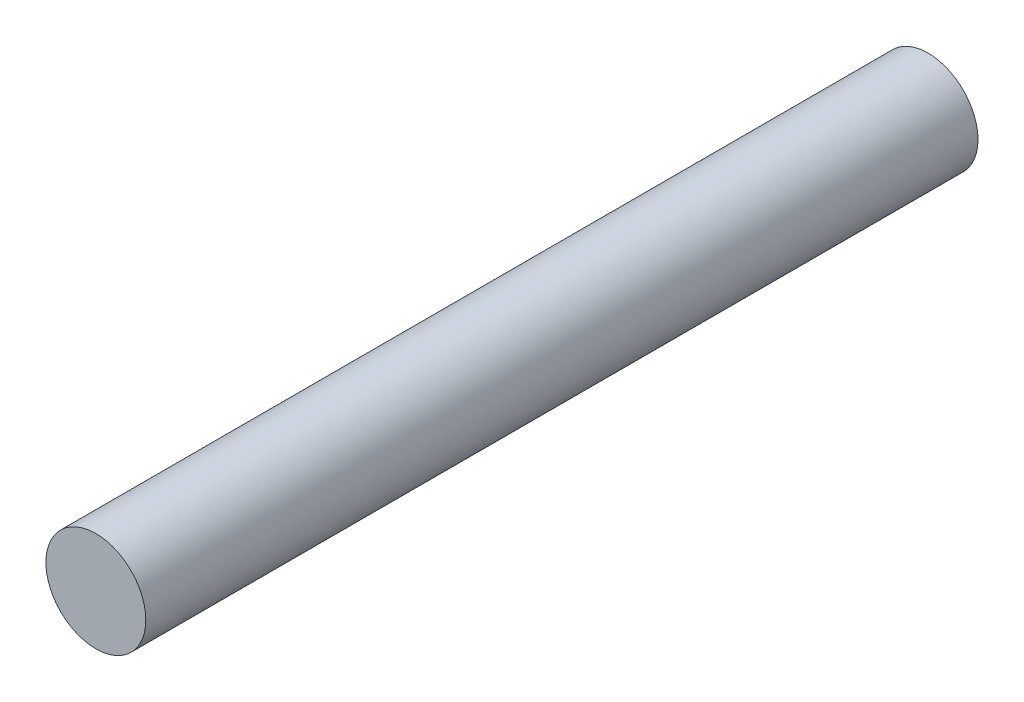
ISO-10303-21;
HEADER;
FILE_DESCRIPTION(('STEP AP214'),'2;1');
FILE_NAME('part.step','',(''),(''),'','','');
FILE_SCHEMA(('AUTOMOTIVE_DESIGN { 1 0 10303 214 1 1 1 1 }'));
ENDSEC;
DATA;
#1=APPLICATION_CONTEXT('core data for automotive mechanical design processes');
#2=APPLICATION_PROTOCOL_DEFINITION('international standard','automotive_design',2000,#1);
#3=PRODUCT_CONTEXT('',#1,'mechanical');
#4=PRODUCT('Part','Part','',(#3));
#5=PRODUCT_RELATED_PRODUCT_CATEGORY('part','',(#4));
#6=PRODUCT_DEFINITION_FORMATION('','',#4);
#7=PRODUCT_DEFINITION_CONTEXT('part definition',#1,'design');
#8=PRODUCT_DEFINITION('design','',#6,#7);
#9=PRODUCT_DEFINITION_SHAPE('','',#8);
#10=(LENGTH_UNIT() NAMED_UNIT(*) SI_UNIT(.MILLI.,.METRE.));
#11=(NAMED_UNIT(*) PLANE_ANGLE_UNIT() SI_UNIT($,.RADIAN.));
#12=(NAMED_UNIT(*) SI_UNIT($,.STERADIAN.) SOLID_ANGLE_UNIT());
#13=UNCERTAINTY_MEASURE_WITH_UNIT(LENGTH_MEASURE(1.E-05),#10,'distance_accuracy_value','');
#14=(GEOMETRIC_REPRESENTATION_CONTEXT(3) GLOBAL_UNCERTAINTY_ASSIGNED_CONTEXT((#13)) GLOBAL_UNIT_ASSIGNED_CONTEXT((#10,
#11,#12)) REPRESENTATION_CONTEXT('',''));
#15=CARTESIAN_POINT('',(0.,0.,0.));
#16=DIRECTION('',(0.,0.,1.));
#17=DIRECTION('',(1.,0.,0.));
#18=AXIS2_PLACEMENT_3D('',#15,#16,#17);
#19=CARTESIAN_POINT('',(0.,0.,25.));
#20=DIRECTION('',(0.,0.,-1.));
#21=DIRECTION('',(-1.,0.,0.));
#22=AXIS2_PLACEMENT_3D('',#19,#20,#21);
#23=CYLINDRICAL_SURFACE('',#22,1.5);
#24=CARTESIAN_POINT('',(0.,0.,25.));
#25=DIRECTION('',(0.,0.,1.));
#26=DIRECTION('',(1.,0.,0.));
#27=AXIS2_PLACEMENT_3D('',#24,#25,#26);
#28=CIRCLE('',#27,1.5);
#29=CARTESIAN_POINT('',(1.5,0.,25.));
#30=VERTEX_POINT('',#29);
#31=EDGE_CURVE('E10',#30,#30,#28,.T.);
#32=ORIENTED_EDGE('',*,*,#31,.F.);
#33=EDGE_LOOP('',(#32));
#34=FACE_BOUND('',#33,.T.);
#35=CARTESIAN_POINT('',(0.,0.,0.));
#36=DIRECTION('',(0.,0.,1.));
#37=DIRECTION('',(1.,0.,0.));
#38=AXIS2_PLACEMENT_3D('',#35,#36,#37);
#39=CIRCLE('',#38,1.5);
#40=CARTESIAN_POINT('',(1.5,0.,0.));
#41=VERTEX_POINT('',#40);
#42=EDGE_CURVE('E40',#41,#41,#39,.T.);
#43=ORIENTED_EDGE('',*,*,#42,.T.);
#44=EDGE_LOOP('',(#43));
#45=FACE_BOUND('',#44,.T.);
#46=ADVANCED_FACE('F37',(#34,#45),#23,.T.);
#47=CARTESIAN_POINT('',(0.,0.,25.));
#48=DIRECTION('',(0.,0.,1.));
#49=DIRECTION('',(1.,0.,0.));
#50=AXIS2_PLACEMENT_3D('',#47,#48,#49);
#51=PLANE('',#50);
#52=ORIENTED_EDGE('',*,*,#31,.T.);
#53=EDGE_LOOP('',(#52));
#54=FACE_BOUND('',#53,.T.);
#55=ADVANCED_FACE('F52',(#54),#51,.T.);
#56=CARTESIAN_POINT('',(0.,0.,0.));
#57=DIRECTION('',(0.,0.,1.));
#58=DIRECTION('',(1.,0.,0.));
#59=AXIS2_PLACEMENT_3D('',#56,#57,#58);
#60=PLANE('',#59);
#61=ORIENTED_EDGE('',*,*,#42,.F.);
#62=EDGE_LOOP('',(#61));
#63=FACE_BOUND('',#62,.T.);
#64=ADVANCED_FACE('F50',(#63),#60,.F.);
#65=CLOSED_SHELL('',(#46,#55,#64));
#66=MANIFOLD_SOLID_BREP('B2',#65);
#67=ADVANCED_BREP_SHAPE_REPRESENTATION('',(#18,#66),#14);
#68=SHAPE_DEFINITION_REPRESENTATION(#9,#67);
ENDSEC;
END-ISO-10303-21;
